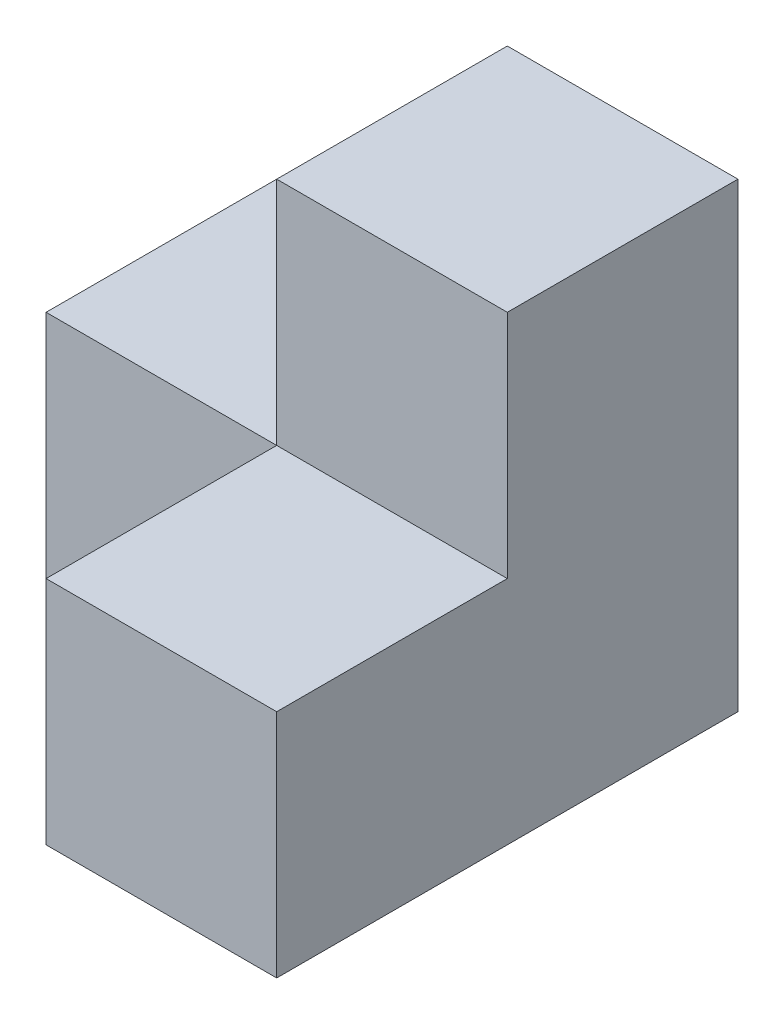
ISO-10303-21;
HEADER;
FILE_DESCRIPTION(('STEP AP214'),'2;1');
FILE_NAME('part.step','',(''),(''),'','','');
FILE_SCHEMA(('AUTOMOTIVE_DESIGN { 1 0 10303 214 1 1 1 1 }'));
ENDSEC;
DATA;
#1=APPLICATION_CONTEXT('core data for automotive mechanical design processes');
#2=APPLICATION_PROTOCOL_DEFINITION('international standard','automotive_design',2000,#1);
#3=PRODUCT_CONTEXT('',#1,'mechanical');
#4=PRODUCT('Part','Part','',(#3));
#5=PRODUCT_RELATED_PRODUCT_CATEGORY('part','',(#4));
#6=PRODUCT_DEFINITION_FORMATION('','',#4);
#7=PRODUCT_DEFINITION_CONTEXT('part definition',#1,'design');
#8=PRODUCT_DEFINITION('design','',#6,#7);
#9=PRODUCT_DEFINITION_SHAPE('','',#8);
#10=(LENGTH_UNIT() NAMED_UNIT(*) SI_UNIT(.MILLI.,.METRE.));
#11=(NAMED_UNIT(*) PLANE_ANGLE_UNIT() SI_UNIT($,.RADIAN.));
#12=(NAMED_UNIT(*) SI_UNIT($,.STERADIAN.) SOLID_ANGLE_UNIT());
#13=UNCERTAINTY_MEASURE_WITH_UNIT(LENGTH_MEASURE(1.E-05),#10,'distance_accuracy_value','');
#14=(GEOMETRIC_REPRESENTATION_CONTEXT(3) GLOBAL_UNCERTAINTY_ASSIGNED_CONTEXT((#13)) GLOBAL_UNIT_ASSIGNED_CONTEXT((#10,
#11,#12)) REPRESENTATION_CONTEXT('',''));
#15=CARTESIAN_POINT('',(0.,0.,0.));
#16=DIRECTION('',(0.,0.,1.));
#17=DIRECTION('',(1.,0.,0.));
#18=AXIS2_PLACEMENT_3D('',#15,#16,#17);
#19=CARTESIAN_POINT('',(0.,25.4,0.));
#20=DIRECTION('',(0.,-1.,0.));
#21=DIRECTION('',(0.,0.,-1.));
#22=AXIS2_PLACEMENT_3D('',#19,#20,#21);
#23=PLANE('',#22);
#24=DIRECTION('',(0.,0.,1.));
#25=VECTOR('',#24,1.);
#26=CARTESIAN_POINT('',(0.,25.4,0.));
#27=LINE('',#26,#25);
#28=CARTESIAN_POINT('',(0.,25.4,-25.4));
#29=VERTEX_POINT('',#28);
#30=CARTESIAN_POINT('',(0.,25.4,0.));
#31=VERTEX_POINT('',#30);
#32=EDGE_CURVE('E51',#29,#31,#27,.T.);
#33=ORIENTED_EDGE('',*,*,#32,.F.);
#34=DIRECTION('',(-1.,0.,0.));
#35=VECTOR('',#34,1.);
#36=CARTESIAN_POINT('',(-25.4,25.4,-25.4));
#37=LINE('',#36,#35);
#38=CARTESIAN_POINT('',(-25.4,25.4,-25.4));
#39=VERTEX_POINT('',#38);
#40=EDGE_CURVE('E127',#29,#39,#37,.T.);
#41=ORIENTED_EDGE('',*,*,#40,.T.);
#42=DIRECTION('',(0.,0.,1.));
#43=VECTOR('',#42,1.);
#44=CARTESIAN_POINT('',(-25.4,25.4,25.4));
#45=LINE('',#44,#43);
#46=CARTESIAN_POINT('',(-25.4,25.4,0.));
#47=VERTEX_POINT('',#46);
#48=EDGE_CURVE('E172',#39,#47,#45,.T.);
#49=ORIENTED_EDGE('',*,*,#48,.T.);
#50=DIRECTION('',(-1.,0.,0.));
#51=VECTOR('',#50,1.);
#52=CARTESIAN_POINT('',(-25.4,25.4,0.));
#53=LINE('',#52,#51);
#54=EDGE_CURVE('E131',#31,#47,#53,.T.);
#55=ORIENTED_EDGE('',*,*,#54,.F.);
#56=EDGE_LOOP('',(#33,#41,#49,#55));
#57=FACE_BOUND('',#56,.T.);
#58=ADVANCED_FACE('F33',(#57),#23,.F.);
#59=CARTESIAN_POINT('',(25.4,25.4,25.4));
#60=DIRECTION('',(-1.,0.,0.));
#61=DIRECTION('',(0.,0.,1.));
#62=AXIS2_PLACEMENT_3D('',#59,#60,#61);
#63=PLANE('',#62);
#64=DIRECTION('',(0.,0.,-1.));
#65=VECTOR('',#64,1.);
#66=CARTESIAN_POINT('',(25.4,0.,25.4));
#67=LINE('',#66,#65);
#68=CARTESIAN_POINT('',(25.4,0.,25.4));
#69=VERTEX_POINT('',#68);
#70=CARTESIAN_POINT('',(25.4,0.,-25.4));
#71=VERTEX_POINT('',#70);
#72=EDGE_CURVE('E159',#69,#71,#67,.T.);
#73=ORIENTED_EDGE('',*,*,#72,.T.);
#74=DIRECTION('',(0.,-1.,0.));
#75=VECTOR('',#74,1.);
#76=CARTESIAN_POINT('',(25.4,25.4,-25.4));
#77=LINE('',#76,#75);
#78=CARTESIAN_POINT('',(25.4,50.8,-25.4));
#79=VERTEX_POINT('',#78);
#80=EDGE_CURVE('E11',#79,#71,#77,.T.);
#81=ORIENTED_EDGE('',*,*,#80,.F.);
#82=DIRECTION('',(0.,0.,-1.));
#83=VECTOR('',#82,1.);
#84=CARTESIAN_POINT('',(25.4,50.8,0.));
#85=LINE('',#84,#83);
#86=CARTESIAN_POINT('',(25.4,50.8,0.));
#87=VERTEX_POINT('',#86);
#88=EDGE_CURVE('E122',#87,#79,#85,.T.);
#89=ORIENTED_EDGE('',*,*,#88,.F.);
#90=DIRECTION('',(0.,-1.,0.));
#91=VECTOR('',#90,1.);
#92=CARTESIAN_POINT('',(25.4,50.8,0.));
#93=LINE('',#92,#91);
#94=CARTESIAN_POINT('',(25.4,25.4,0.));
#95=VERTEX_POINT('',#94);
#96=EDGE_CURVE('E133',#87,#95,#93,.T.);
#97=ORIENTED_EDGE('',*,*,#96,.T.);
#98=DIRECTION('',(0.,0.,-1.));
#99=VECTOR('',#98,1.);
#100=CARTESIAN_POINT('',(25.4,25.4,25.4));
#101=LINE('',#100,#99);
#102=CARTESIAN_POINT('',(25.4,25.4,25.4));
#103=VERTEX_POINT('',#102);
#104=EDGE_CURVE('E59',#103,#95,#101,.T.);
#105=ORIENTED_EDGE('',*,*,#104,.F.);
#106=DIRECTION('',(0.,-1.,0.));
#107=VECTOR('',#106,1.);
#108=CARTESIAN_POINT('',(25.4,25.4,25.4));
#109=LINE('',#108,#107);
#110=EDGE_CURVE('E192',#103,#69,#109,.T.);
#111=ORIENTED_EDGE('',*,*,#110,.T.);
#112=EDGE_LOOP('',(#73,#81,#89,#97,#105,#111));
#113=FACE_BOUND('',#112,.T.);
#114=ADVANCED_FACE('F35',(#113),#63,.F.);
#115=CARTESIAN_POINT('',(-25.4,25.4,-25.4));
#116=DIRECTION('',(0.,0.,1.));
#117=DIRECTION('',(1.,0.,0.));
#118=AXIS2_PLACEMENT_3D('',#115,#116,#117);
#119=PLANE('',#118);
#120=DIRECTION('',(-1.,0.,0.));
#121=VECTOR('',#120,1.);
#122=CARTESIAN_POINT('',(-25.4,0.,-25.4));
#123=LINE('',#122,#121);
#124=CARTESIAN_POINT('',(-25.4,0.,-25.4));
#125=VERTEX_POINT('',#124);
#126=EDGE_CURVE('E181',#71,#125,#123,.T.);
#127=ORIENTED_EDGE('',*,*,#126,.T.);
#128=DIRECTION('',(0.,-1.,0.));
#129=VECTOR('',#128,1.);
#130=CARTESIAN_POINT('',(-25.4,25.4,-25.4));
#131=LINE('',#130,#129);
#132=EDGE_CURVE('E43',#39,#125,#131,.T.);
#133=ORIENTED_EDGE('',*,*,#132,.F.);
#134=ORIENTED_EDGE('',*,*,#40,.F.);
#135=DIRECTION('',(0.,-1.,0.));
#136=VECTOR('',#135,1.);
#137=CARTESIAN_POINT('',(0.,50.8,-25.4));
#138=LINE('',#137,#136);
#139=CARTESIAN_POINT('',(0.,50.8,-25.4));
#140=VERTEX_POINT('',#139);
#141=EDGE_CURVE('E109',#140,#29,#138,.T.);
#142=ORIENTED_EDGE('',*,*,#141,.F.);
#143=DIRECTION('',(-1.,0.,0.));
#144=VECTOR('',#143,1.);
#145=CARTESIAN_POINT('',(0.,50.8,-25.4));
#146=LINE('',#145,#144);
#147=EDGE_CURVE('E116',#79,#140,#146,.T.);
#148=ORIENTED_EDGE('',*,*,#147,.F.);
#149=ORIENTED_EDGE('',*,*,#80,.T.);
#150=EDGE_LOOP('',(#127,#133,#134,#142,#148,#149));
#151=FACE_BOUND('',#150,.T.);
#152=ADVANCED_FACE('F125',(#151),#119,.F.);
#153=CARTESIAN_POINT('',(-25.4,25.4,25.4));
#154=DIRECTION('',(1.,0.,0.));
#155=DIRECTION('',(0.,0.,-1.));
#156=AXIS2_PLACEMENT_3D('',#153,#154,#155);
#157=PLANE('',#156);
#158=DIRECTION('',(0.,0.,1.));
#159=VECTOR('',#158,1.);
#160=CARTESIAN_POINT('',(-25.4,0.,25.4));
#161=LINE('',#160,#159);
#162=CARTESIAN_POINT('',(-25.4,0.,0.));
#163=VERTEX_POINT('',#162);
#164=EDGE_CURVE('E186',#125,#163,#161,.T.);
#165=ORIENTED_EDGE('',*,*,#164,.T.);
#166=DIRECTION('',(0.,1.,0.));
#167=VECTOR('',#166,1.);
#168=CARTESIAN_POINT('',(-25.4,0.,0.));
#169=LINE('',#168,#167);
#170=EDGE_CURVE('E156',#163,#47,#169,.T.);
#171=ORIENTED_EDGE('',*,*,#170,.T.);
#172=ORIENTED_EDGE('',*,*,#48,.F.);
#173=ORIENTED_EDGE('',*,*,#132,.T.);
#174=EDGE_LOOP('',(#165,#171,#172,#173));
#175=FACE_BOUND('',#174,.T.);
#176=ADVANCED_FACE('F190',(#175),#157,.F.);
#177=CARTESIAN_POINT('',(-25.4,25.4,25.4));
#178=DIRECTION('',(0.,0.,-1.));
#179=DIRECTION('',(-1.,0.,0.));
#180=AXIS2_PLACEMENT_3D('',#177,#178,#179);
#181=PLANE('',#180);
#182=DIRECTION('',(1.,0.,0.));
#183=VECTOR('',#182,1.);
#184=CARTESIAN_POINT('',(-25.4,25.4,25.4));
#185=LINE('',#184,#183);
#186=CARTESIAN_POINT('',(0.,25.4,25.4));
#187=VERTEX_POINT('',#186);
#188=EDGE_CURVE('E198',#187,#103,#185,.T.);
#189=ORIENTED_EDGE('',*,*,#188,.F.);
#190=DIRECTION('',(0.,1.,0.));
#191=VECTOR('',#190,1.);
#192=CARTESIAN_POINT('',(0.,0.,25.4));
#193=LINE('',#192,#191);
#194=CARTESIAN_POINT('',(0.,0.,25.4));
#195=VERTEX_POINT('',#194);
#196=EDGE_CURVE('E153',#195,#187,#193,.T.);
#197=ORIENTED_EDGE('',*,*,#196,.F.);
#198=DIRECTION('',(1.,0.,0.));
#199=VECTOR('',#198,1.);
#200=CARTESIAN_POINT('',(-25.4,0.,25.4));
#201=LINE('',#200,#199);
#202=EDGE_CURVE('E170',#195,#69,#201,.T.);
#203=ORIENTED_EDGE('',*,*,#202,.T.);
#204=ORIENTED_EDGE('',*,*,#110,.F.);
#205=EDGE_LOOP('',(#189,#197,#203,#204));
#206=FACE_BOUND('',#205,.T.);
#207=ADVANCED_FACE('F222',(#206),#181,.F.);
#208=ORIENTED_EDGE('',*,*,#104,.T.);
#209=DIRECTION('',(-1.,0.,0.));
#210=VECTOR('',#209,1.);
#211=CARTESIAN_POINT('',(0.,25.4,0.));
#212=LINE('',#211,#210);
#213=EDGE_CURVE('E37',#95,#31,#212,.T.);
#214=ORIENTED_EDGE('',*,*,#213,.T.);
#215=DIRECTION('',(0.,0.,-1.));
#216=VECTOR('',#215,1.);
#217=CARTESIAN_POINT('',(0.,25.4,25.4));
#218=LINE('',#217,#216);
#219=EDGE_CURVE('E128',#187,#31,#218,.T.);
#220=ORIENTED_EDGE('',*,*,#219,.F.);
#221=ORIENTED_EDGE('',*,*,#188,.T.);
#222=EDGE_LOOP('',(#208,#214,#220,#221));
#223=FACE_BOUND('',#222,.T.);
#224=ADVANCED_FACE('F174',(#223),#23,.F.);
#225=CARTESIAN_POINT('',(0.,0.,0.));
#226=DIRECTION('',(0.,-1.,0.));
#227=DIRECTION('',(0.,0.,-1.));
#228=AXIS2_PLACEMENT_3D('',#225,#226,#227);
#229=PLANE('',#228);
#230=DIRECTION('',(-1.,0.,0.));
#231=VECTOR('',#230,1.);
#232=CARTESIAN_POINT('',(-25.4,0.,0.));
#233=LINE('',#232,#231);
#234=CARTESIAN_POINT('',(0.,0.,0.));
#235=VERTEX_POINT('',#234);
#236=EDGE_CURVE('E151',#235,#163,#233,.T.);
#237=ORIENTED_EDGE('',*,*,#236,.T.);
#238=ORIENTED_EDGE('',*,*,#164,.F.);
#239=ORIENTED_EDGE('',*,*,#126,.F.);
#240=ORIENTED_EDGE('',*,*,#72,.F.);
#241=ORIENTED_EDGE('',*,*,#202,.F.);
#242=DIRECTION('',(0.,0.,-1.));
#243=VECTOR('',#242,1.);
#244=CARTESIAN_POINT('',(0.,0.,25.4));
#245=LINE('',#244,#243);
#246=EDGE_CURVE('E148',#195,#235,#245,.T.);
#247=ORIENTED_EDGE('',*,*,#246,.T.);
#248=EDGE_LOOP('',(#237,#238,#239,#240,#241,#247));
#249=FACE_BOUND('',#248,.T.);
#250=ADVANCED_FACE('F193',(#249),#229,.T.);
#251=CARTESIAN_POINT('',(-25.4,0.,0.));
#252=DIRECTION('',(0.,0.,-1.));
#253=DIRECTION('',(-1.,0.,0.));
#254=AXIS2_PLACEMENT_3D('',#251,#252,#253);
#255=PLANE('',#254);
#256=ORIENTED_EDGE('',*,*,#54,.T.);
#257=ORIENTED_EDGE('',*,*,#170,.F.);
#258=ORIENTED_EDGE('',*,*,#236,.F.);
#259=DIRECTION('',(0.,1.,0.));
#260=VECTOR('',#259,1.);
#261=CARTESIAN_POINT('',(0.,0.,0.));
#262=LINE('',#261,#260);
#263=EDGE_CURVE('E160',#235,#31,#262,.T.);
#264=ORIENTED_EDGE('',*,*,#263,.T.);
#265=EDGE_LOOP('',(#256,#257,#258,#264));
#266=FACE_BOUND('',#265,.T.);
#267=ADVANCED_FACE('F206',(#266),#255,.F.);
#268=CARTESIAN_POINT('',(0.,0.,25.4));
#269=DIRECTION('',(1.,0.,0.));
#270=DIRECTION('',(0.,0.,-1.));
#271=AXIS2_PLACEMENT_3D('',#268,#269,#270);
#272=PLANE('',#271);
#273=ORIENTED_EDGE('',*,*,#219,.T.);
#274=ORIENTED_EDGE('',*,*,#263,.F.);
#275=ORIENTED_EDGE('',*,*,#246,.F.);
#276=ORIENTED_EDGE('',*,*,#196,.T.);
#277=EDGE_LOOP('',(#273,#274,#275,#276));
#278=FACE_BOUND('',#277,.T.);
#279=ADVANCED_FACE('F204',(#278),#272,.F.);
#280=CARTESIAN_POINT('',(0.,50.8,0.));
#281=DIRECTION('',(1.,0.,0.));
#282=DIRECTION('',(0.,0.,-1.));
#283=AXIS2_PLACEMENT_3D('',#280,#281,#282);
#284=PLANE('',#283);
#285=ORIENTED_EDGE('',*,*,#32,.T.);
#286=DIRECTION('',(0.,-1.,0.));
#287=VECTOR('',#286,1.);
#288=CARTESIAN_POINT('',(0.,50.8,0.));
#289=LINE('',#288,#287);
#290=CARTESIAN_POINT('',(0.,50.8,0.));
#291=VERTEX_POINT('',#290);
#292=EDGE_CURVE('E111',#291,#31,#289,.T.);
#293=ORIENTED_EDGE('',*,*,#292,.F.);
#294=DIRECTION('',(0.,0.,1.));
#295=VECTOR('',#294,1.);
#296=CARTESIAN_POINT('',(0.,50.8,0.));
#297=LINE('',#296,#295);
#298=EDGE_CURVE('E105',#140,#291,#297,.T.);
#299=ORIENTED_EDGE('',*,*,#298,.F.);
#300=ORIENTED_EDGE('',*,*,#141,.T.);
#301=EDGE_LOOP('',(#285,#293,#299,#300));
#302=FACE_BOUND('',#301,.T.);
#303=ADVANCED_FACE('F107',(#302),#284,.F.);
#304=CARTESIAN_POINT('',(0.,50.8,0.));
#305=DIRECTION('',(0.,0.,1.));
#306=DIRECTION('',(1.,0.,0.));
#307=AXIS2_PLACEMENT_3D('',#304,#305,#306);
#308=PLANE('',#307);
#309=ORIENTED_EDGE('',*,*,#213,.F.);
#310=ORIENTED_EDGE('',*,*,#96,.F.);
#311=DIRECTION('',(-1.,0.,0.));
#312=VECTOR('',#311,1.);
#313=CARTESIAN_POINT('',(0.,50.8,0.));
#314=LINE('',#313,#312);
#315=EDGE_CURVE('E115',#87,#291,#314,.T.);
#316=ORIENTED_EDGE('',*,*,#315,.T.);
#317=ORIENTED_EDGE('',*,*,#292,.T.);
#318=EDGE_LOOP('',(#309,#310,#316,#317));
#319=FACE_BOUND('',#318,.T.);
#320=ADVANCED_FACE('F177',(#319),#308,.T.);
#321=CARTESIAN_POINT('',(0.,50.8,0.));
#322=DIRECTION('',(0.,1.,0.));
#323=DIRECTION('',(0.,0.,1.));
#324=AXIS2_PLACEMENT_3D('',#321,#322,#323);
#325=PLANE('',#324);
#326=ORIENTED_EDGE('',*,*,#147,.T.);
#327=ORIENTED_EDGE('',*,*,#298,.T.);
#328=ORIENTED_EDGE('',*,*,#315,.F.);
#329=ORIENTED_EDGE('',*,*,#88,.T.);
#330=EDGE_LOOP('',(#326,#327,#328,#329));
#331=FACE_BOUND('',#330,.T.);
#332=ADVANCED_FACE('F120',(#331),#325,.T.);
#333=CLOSED_SHELL('',(#58,#114,#152,#176,#207,#224,#250,#267,#279,#303,#320,#332));
#334=MANIFOLD_SOLID_BREP('B2',#333);
#335=ADVANCED_BREP_SHAPE_REPRESENTATION('',(#18,#334),#14);
#336=SHAPE_DEFINITION_REPRESENTATION(#9,#335);
ENDSEC;
END-ISO-10303-21;
